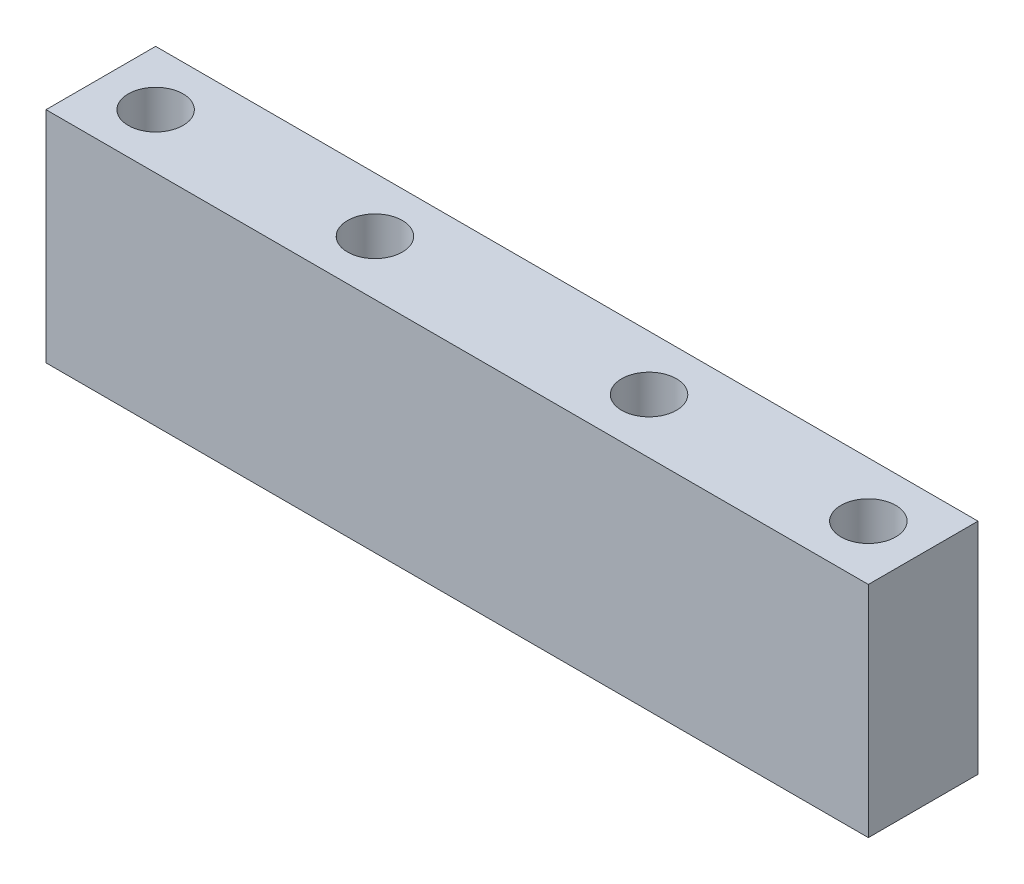
ISO-10303-21;
HEADER;
FILE_DESCRIPTION(('STEP AP214'),'2;1');
FILE_NAME('part.step','',(''),(''),'','','');
FILE_SCHEMA(('AUTOMOTIVE_DESIGN { 1 0 10303 214 1 1 1 1 }'));
ENDSEC;
DATA;
#1=APPLICATION_CONTEXT('core data for automotive mechanical design processes');
#2=APPLICATION_PROTOCOL_DEFINITION('international standard','automotive_design',2000,#1);
#3=PRODUCT_CONTEXT('',#1,'mechanical');
#4=PRODUCT('Part','Part','',(#3));
#5=PRODUCT_RELATED_PRODUCT_CATEGORY('part','',(#4));
#6=PRODUCT_DEFINITION_FORMATION('','',#4);
#7=PRODUCT_DEFINITION_CONTEXT('part definition',#1,'design');
#8=PRODUCT_DEFINITION('design','',#6,#7);
#9=PRODUCT_DEFINITION_SHAPE('','',#8);
#10=(LENGTH_UNIT() NAMED_UNIT(*) SI_UNIT(.MILLI.,.METRE.));
#11=(NAMED_UNIT(*) PLANE_ANGLE_UNIT() SI_UNIT($,.RADIAN.));
#12=(NAMED_UNIT(*) SI_UNIT($,.STERADIAN.) SOLID_ANGLE_UNIT());
#13=UNCERTAINTY_MEASURE_WITH_UNIT(LENGTH_MEASURE(1.E-05),#10,'distance_accuracy_value','');
#14=(GEOMETRIC_REPRESENTATION_CONTEXT(3) GLOBAL_UNCERTAINTY_ASSIGNED_CONTEXT((#13)) GLOBAL_UNIT_ASSIGNED_CONTEXT((#10,
#11,#12)) REPRESENTATION_CONTEXT('',''));
#15=CARTESIAN_POINT('',(0.,0.,0.));
#16=DIRECTION('',(0.,0.,1.));
#17=DIRECTION('',(1.,0.,0.));
#18=AXIS2_PLACEMENT_3D('',#15,#16,#17);
#19=CARTESIAN_POINT('',(0.,25.4,0.));
#20=DIRECTION('',(0.,1.,0.));
#21=DIRECTION('',(0.,0.,1.));
#22=AXIS2_PLACEMENT_3D('',#19,#20,#21);
#23=PLANE('',#22);
#24=CARTESIAN_POINT('',(-15.875,25.4,0.));
#25=DIRECTION('',(0.,1.,0.));
#26=DIRECTION('',(0.,0.,1.));
#27=AXIS2_PLACEMENT_3D('',#24,#25,#26);
#28=CIRCLE('',#27,3.175);
#29=CARTESIAN_POINT('',(-15.875,25.4,3.17500000000001));
#30=VERTEX_POINT('',#29);
#31=EDGE_CURVE('E142',#30,#30,#28,.T.);
#32=ORIENTED_EDGE('',*,*,#31,.F.);
#33=EDGE_LOOP('',(#32));
#34=FACE_BOUND('',#33,.T.);
#35=CARTESIAN_POINT('',(-41.275,25.4,0.));
#36=DIRECTION('',(0.,1.,0.));
#37=DIRECTION('',(0.,0.,1.));
#38=AXIS2_PLACEMENT_3D('',#35,#36,#37);
#39=CIRCLE('',#38,3.175);
#40=CARTESIAN_POINT('',(-41.275,25.4,3.175));
#41=VERTEX_POINT('',#40);
#42=EDGE_CURVE('E112',#41,#41,#39,.T.);
#43=ORIENTED_EDGE('',*,*,#42,.F.);
#44=EDGE_LOOP('',(#43));
#45=FACE_BOUND('',#44,.T.);
#46=DIRECTION('',(0.,0.,1.));
#47=VECTOR('',#46,1.);
#48=CARTESIAN_POINT('',(-47.625,25.4,-6.35));
#49=LINE('',#48,#47);
#50=CARTESIAN_POINT('',(-47.625,25.4,-6.35));
#51=VERTEX_POINT('',#50);
#52=CARTESIAN_POINT('',(-47.625,25.4,6.35));
#53=VERTEX_POINT('',#52);
#54=EDGE_CURVE('E92',#51,#53,#49,.T.);
#55=ORIENTED_EDGE('',*,*,#54,.T.);
#56=DIRECTION('',(1.,0.,0.));
#57=VECTOR('',#56,1.);
#58=CARTESIAN_POINT('',(-47.625,25.4,6.35));
#59=LINE('',#58,#57);
#60=CARTESIAN_POINT('',(47.625,25.4,6.35));
#61=VERTEX_POINT('',#60);
#62=EDGE_CURVE('E87',#53,#61,#59,.T.);
#63=ORIENTED_EDGE('',*,*,#62,.T.);
#64=DIRECTION('',(0.,0.,-1.));
#65=VECTOR('',#64,1.);
#66=CARTESIAN_POINT('',(47.625,25.4,-6.35));
#67=LINE('',#66,#65);
#68=CARTESIAN_POINT('',(47.625,25.4,-6.35));
#69=VERTEX_POINT('',#68);
#70=EDGE_CURVE('E90',#61,#69,#67,.T.);
#71=ORIENTED_EDGE('',*,*,#70,.T.);
#72=DIRECTION('',(-1.,0.,0.));
#73=VECTOR('',#72,1.);
#74=CARTESIAN_POINT('',(-47.625,25.4,-6.35));
#75=LINE('',#74,#73);
#76=EDGE_CURVE('E57',#69,#51,#75,.T.);
#77=ORIENTED_EDGE('',*,*,#76,.T.);
#78=EDGE_LOOP('',(#55,#63,#71,#77));
#79=FACE_BOUND('',#78,.T.);
#80=CARTESIAN_POINT('',(41.275,25.4,0.));
#81=DIRECTION('',(0.,1.,0.));
#82=DIRECTION('',(0.,0.,1.));
#83=AXIS2_PLACEMENT_3D('',#80,#81,#82);
#84=CIRCLE('',#83,3.175);
#85=CARTESIAN_POINT('',(41.275,25.4,3.175));
#86=VERTEX_POINT('',#85);
#87=EDGE_CURVE('E134',#86,#86,#84,.T.);
#88=ORIENTED_EDGE('',*,*,#87,.F.);
#89=EDGE_LOOP('',(#88));
#90=FACE_BOUND('',#89,.T.);
#91=CARTESIAN_POINT('',(15.875,25.4,0.));
#92=DIRECTION('',(0.,1.,0.));
#93=DIRECTION('',(0.,0.,1.));
#94=AXIS2_PLACEMENT_3D('',#91,#92,#93);
#95=CIRCLE('',#94,3.175);
#96=CARTESIAN_POINT('',(15.875,25.4,3.175));
#97=VERTEX_POINT('',#96);
#98=EDGE_CURVE('E150',#97,#97,#95,.T.);
#99=ORIENTED_EDGE('',*,*,#98,.F.);
#100=EDGE_LOOP('',(#99));
#101=FACE_BOUND('',#100,.T.);
#102=ADVANCED_FACE('F39',(#34,#45,#79,#90,#101),#23,.T.);
#103=CARTESIAN_POINT('',(0.,0.,0.));
#104=DIRECTION('',(0.,1.,0.));
#105=DIRECTION('',(0.,0.,1.));
#106=AXIS2_PLACEMENT_3D('',#103,#104,#105);
#107=PLANE('',#106);
#108=DIRECTION('',(0.,0.,1.));
#109=VECTOR('',#108,1.);
#110=CARTESIAN_POINT('',(-47.625,0.,-6.35));
#111=LINE('',#110,#109);
#112=CARTESIAN_POINT('',(-47.625,0.,-6.35));
#113=VERTEX_POINT('',#112);
#114=CARTESIAN_POINT('',(-47.625,0.,6.35));
#115=VERTEX_POINT('',#114);
#116=EDGE_CURVE('E108',#113,#115,#111,.T.);
#117=ORIENTED_EDGE('',*,*,#116,.F.);
#118=DIRECTION('',(-1.,0.,0.));
#119=VECTOR('',#118,1.);
#120=CARTESIAN_POINT('',(-47.625,0.,-6.35));
#121=LINE('',#120,#119);
#122=CARTESIAN_POINT('',(47.625,0.,-6.35));
#123=VERTEX_POINT('',#122);
#124=EDGE_CURVE('E80',#123,#113,#121,.T.);
#125=ORIENTED_EDGE('',*,*,#124,.F.);
#126=DIRECTION('',(0.,0.,-1.));
#127=VECTOR('',#126,1.);
#128=CARTESIAN_POINT('',(47.625,0.,-6.35));
#129=LINE('',#128,#127);
#130=CARTESIAN_POINT('',(47.625,0.,6.35));
#131=VERTEX_POINT('',#130);
#132=EDGE_CURVE('E74',#131,#123,#129,.T.);
#133=ORIENTED_EDGE('',*,*,#132,.F.);
#134=DIRECTION('',(1.,0.,0.));
#135=VECTOR('',#134,1.);
#136=CARTESIAN_POINT('',(-47.625,0.,6.35));
#137=LINE('',#136,#135);
#138=EDGE_CURVE('E97',#115,#131,#137,.T.);
#139=ORIENTED_EDGE('',*,*,#138,.F.);
#140=EDGE_LOOP('',(#117,#125,#133,#139));
#141=FACE_BOUND('',#140,.T.);
#142=CARTESIAN_POINT('',(-41.275,0.,0.));
#143=DIRECTION('',(0.,1.,0.));
#144=DIRECTION('',(0.,0.,1.));
#145=AXIS2_PLACEMENT_3D('',#142,#143,#144);
#146=CIRCLE('',#145,3.175);
#147=CARTESIAN_POINT('',(-41.275,0.,3.175));
#148=VERTEX_POINT('',#147);
#149=EDGE_CURVE('E130',#148,#148,#146,.T.);
#150=ORIENTED_EDGE('',*,*,#149,.T.);
#151=EDGE_LOOP('',(#150));
#152=FACE_BOUND('',#151,.T.);
#153=CARTESIAN_POINT('',(41.275,0.,0.));
#154=DIRECTION('',(0.,1.,0.));
#155=DIRECTION('',(0.,0.,1.));
#156=AXIS2_PLACEMENT_3D('',#153,#154,#155);
#157=CIRCLE('',#156,3.175);
#158=CARTESIAN_POINT('',(41.275,0.,3.175));
#159=VERTEX_POINT('',#158);
#160=EDGE_CURVE('E138',#159,#159,#157,.T.);
#161=ORIENTED_EDGE('',*,*,#160,.T.);
#162=EDGE_LOOP('',(#161));
#163=FACE_BOUND('',#162,.T.);
#164=CARTESIAN_POINT('',(-15.875,0.,0.));
#165=DIRECTION('',(0.,1.,0.));
#166=DIRECTION('',(0.,0.,1.));
#167=AXIS2_PLACEMENT_3D('',#164,#165,#166);
#168=CIRCLE('',#167,3.175);
#169=CARTESIAN_POINT('',(-15.875,0.,3.17500000000001));
#170=VERTEX_POINT('',#169);
#171=EDGE_CURVE('E146',#170,#170,#168,.T.);
#172=ORIENTED_EDGE('',*,*,#171,.T.);
#173=EDGE_LOOP('',(#172));
#174=FACE_BOUND('',#173,.T.);
#175=CARTESIAN_POINT('',(15.875,0.,0.));
#176=DIRECTION('',(0.,1.,0.));
#177=DIRECTION('',(0.,0.,1.));
#178=AXIS2_PLACEMENT_3D('',#175,#176,#177);
#179=CIRCLE('',#178,3.175);
#180=CARTESIAN_POINT('',(15.875,0.,3.175));
#181=VERTEX_POINT('',#180);
#182=EDGE_CURVE('E154',#181,#181,#179,.T.);
#183=ORIENTED_EDGE('',*,*,#182,.T.);
#184=EDGE_LOOP('',(#183));
#185=FACE_BOUND('',#184,.T.);
#186=ADVANCED_FACE('F125',(#141,#152,#163,#174,#185),#107,.F.);
#187=CARTESIAN_POINT('',(-47.625,25.4,-6.35));
#188=DIRECTION('',(1.,0.,0.));
#189=DIRECTION('',(0.,0.,-1.));
#190=AXIS2_PLACEMENT_3D('',#187,#188,#189);
#191=PLANE('',#190);
#192=ORIENTED_EDGE('',*,*,#116,.T.);
#193=DIRECTION('',(0.,-1.,0.));
#194=VECTOR('',#193,1.);
#195=CARTESIAN_POINT('',(-47.625,25.4,6.35));
#196=LINE('',#195,#194);
#197=EDGE_CURVE('E11',#53,#115,#196,.T.);
#198=ORIENTED_EDGE('',*,*,#197,.F.);
#199=ORIENTED_EDGE('',*,*,#54,.F.);
#200=DIRECTION('',(0.,-1.,0.));
#201=VECTOR('',#200,1.);
#202=CARTESIAN_POINT('',(-47.625,25.4,-6.35));
#203=LINE('',#202,#201);
#204=EDGE_CURVE('E104',#51,#113,#203,.T.);
#205=ORIENTED_EDGE('',*,*,#204,.T.);
#206=EDGE_LOOP('',(#192,#198,#199,#205));
#207=FACE_BOUND('',#206,.T.);
#208=ADVANCED_FACE('F41',(#207),#191,.F.);
#209=CARTESIAN_POINT('',(-47.625,25.4,6.35));
#210=DIRECTION('',(0.,0.,-1.));
#211=DIRECTION('',(-1.,0.,0.));
#212=AXIS2_PLACEMENT_3D('',#209,#210,#211);
#213=PLANE('',#212);
#214=ORIENTED_EDGE('',*,*,#138,.T.);
#215=DIRECTION('',(0.,-1.,0.));
#216=VECTOR('',#215,1.);
#217=CARTESIAN_POINT('',(47.625,25.4,6.35));
#218=LINE('',#217,#216);
#219=EDGE_CURVE('E49',#61,#131,#218,.T.);
#220=ORIENTED_EDGE('',*,*,#219,.F.);
#221=ORIENTED_EDGE('',*,*,#62,.F.);
#222=ORIENTED_EDGE('',*,*,#197,.T.);
#223=EDGE_LOOP('',(#214,#220,#221,#222));
#224=FACE_BOUND('',#223,.T.);
#225=ADVANCED_FACE('F96',(#224),#213,.F.);
#226=CARTESIAN_POINT('',(47.625,25.4,-6.35));
#227=DIRECTION('',(-1.,0.,0.));
#228=DIRECTION('',(0.,0.,1.));
#229=AXIS2_PLACEMENT_3D('',#226,#227,#228);
#230=PLANE('',#229);
#231=ORIENTED_EDGE('',*,*,#132,.T.);
#232=DIRECTION('',(0.,-1.,0.));
#233=VECTOR('',#232,1.);
#234=CARTESIAN_POINT('',(47.625,25.4,-6.35));
#235=LINE('',#234,#233);
#236=EDGE_CURVE('E99',#69,#123,#235,.T.);
#237=ORIENTED_EDGE('',*,*,#236,.F.);
#238=ORIENTED_EDGE('',*,*,#70,.F.);
#239=ORIENTED_EDGE('',*,*,#219,.T.);
#240=EDGE_LOOP('',(#231,#237,#238,#239));
#241=FACE_BOUND('',#240,.T.);
#242=ADVANCED_FACE('F100',(#241),#230,.F.);
#243=CARTESIAN_POINT('',(-47.625,25.4,-6.35));
#244=DIRECTION('',(0.,0.,1.));
#245=DIRECTION('',(1.,0.,0.));
#246=AXIS2_PLACEMENT_3D('',#243,#244,#245);
#247=PLANE('',#246);
#248=ORIENTED_EDGE('',*,*,#124,.T.);
#249=ORIENTED_EDGE('',*,*,#204,.F.);
#250=ORIENTED_EDGE('',*,*,#76,.F.);
#251=ORIENTED_EDGE('',*,*,#236,.T.);
#252=EDGE_LOOP('',(#248,#249,#250,#251));
#253=FACE_BOUND('',#252,.T.);
#254=ADVANCED_FACE('F122',(#253),#247,.F.);
#255=CARTESIAN_POINT('',(-41.275,25.4,0.));
#256=DIRECTION('',(0.,-1.,0.));
#257=DIRECTION('',(0.,0.,-1.));
#258=AXIS2_PLACEMENT_3D('',#255,#256,#257);
#259=CYLINDRICAL_SURFACE('',#258,3.175);
#260=ORIENTED_EDGE('',*,*,#42,.T.);
#261=EDGE_LOOP('',(#260));
#262=FACE_BOUND('',#261,.T.);
#263=ORIENTED_EDGE('',*,*,#149,.F.);
#264=EDGE_LOOP('',(#263));
#265=FACE_BOUND('',#264,.T.);
#266=ADVANCED_FACE('F175',(#262,#265),#259,.F.);
#267=CARTESIAN_POINT('',(41.275,25.4,0.));
#268=DIRECTION('',(0.,-1.,0.));
#269=DIRECTION('',(0.,0.,-1.));
#270=AXIS2_PLACEMENT_3D('',#267,#268,#269);
#271=CYLINDRICAL_SURFACE('',#270,3.175);
#272=ORIENTED_EDGE('',*,*,#87,.T.);
#273=EDGE_LOOP('',(#272));
#274=FACE_BOUND('',#273,.T.);
#275=ORIENTED_EDGE('',*,*,#160,.F.);
#276=EDGE_LOOP('',(#275));
#277=FACE_BOUND('',#276,.T.);
#278=ADVANCED_FACE('F221',(#274,#277),#271,.F.);
#279=CARTESIAN_POINT('',(-15.875,25.4,0.));
#280=DIRECTION('',(0.,-1.,0.));
#281=DIRECTION('',(0.,0.,-1.));
#282=AXIS2_PLACEMENT_3D('',#279,#280,#281);
#283=CYLINDRICAL_SURFACE('',#282,3.175);
#284=ORIENTED_EDGE('',*,*,#31,.T.);
#285=EDGE_LOOP('',(#284));
#286=FACE_BOUND('',#285,.T.);
#287=ORIENTED_EDGE('',*,*,#171,.F.);
#288=EDGE_LOOP('',(#287));
#289=FACE_BOUND('',#288,.T.);
#290=ADVANCED_FACE('F229',(#286,#289),#283,.F.);
#291=CARTESIAN_POINT('',(15.875,25.4,0.));
#292=DIRECTION('',(0.,-1.,0.));
#293=DIRECTION('',(0.,0.,-1.));
#294=AXIS2_PLACEMENT_3D('',#291,#292,#293);
#295=CYLINDRICAL_SURFACE('',#294,3.175);
#296=ORIENTED_EDGE('',*,*,#98,.T.);
#297=EDGE_LOOP('',(#296));
#298=FACE_BOUND('',#297,.T.);
#299=ORIENTED_EDGE('',*,*,#182,.F.);
#300=EDGE_LOOP('',(#299));
#301=FACE_BOUND('',#300,.T.);
#302=ADVANCED_FACE('F162',(#298,#301),#295,.F.);
#303=CLOSED_SHELL('',(#102,#186,#208,#225,#242,#254,#266,#278,#290,#302));
#304=MANIFOLD_SOLID_BREP('B2',#303);
#305=ADVANCED_BREP_SHAPE_REPRESENTATION('',(#18,#304),#14);
#306=SHAPE_DEFINITION_REPRESENTATION(#9,#305);
ENDSEC;
END-ISO-10303-21;
